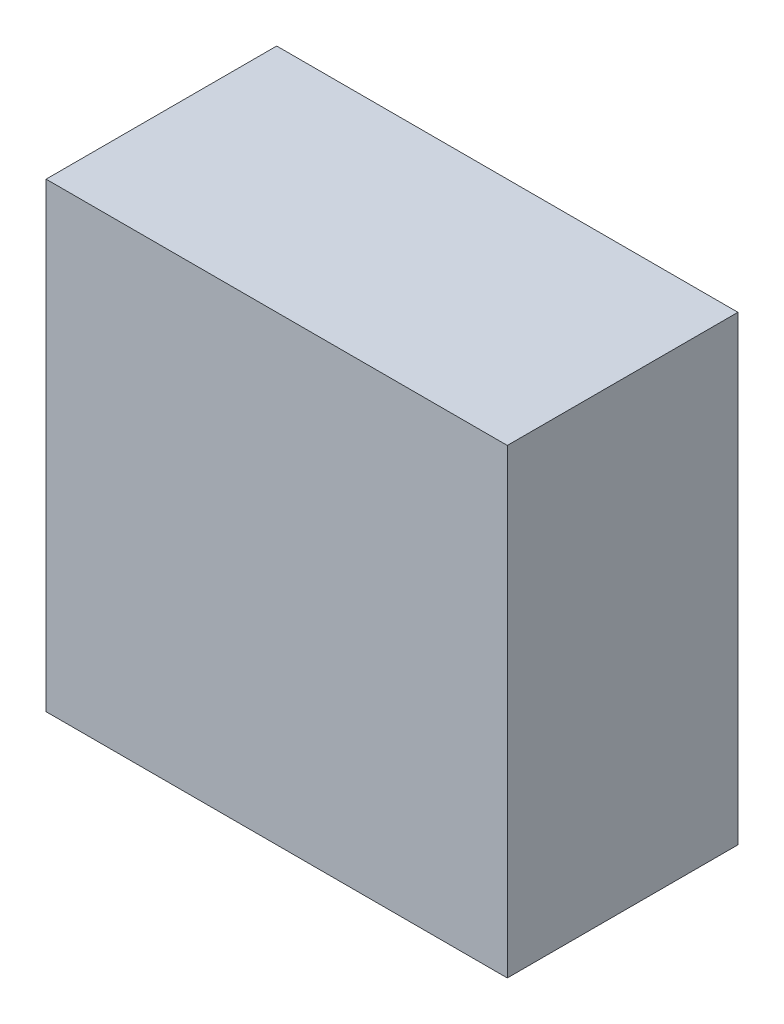
ISO-10303-21;
HEADER;
FILE_DESCRIPTION(('STEP AP214'),'2;1');
FILE_NAME('part.step','',(''),(''),'','','');
FILE_SCHEMA(('AUTOMOTIVE_DESIGN { 1 0 10303 214 1 1 1 1 }'));
ENDSEC;
DATA;
#1=APPLICATION_CONTEXT('core data for automotive mechanical design processes');
#2=APPLICATION_PROTOCOL_DEFINITION('international standard','automotive_design',2000,#1);
#3=PRODUCT_CONTEXT('',#1,'mechanical');
#4=PRODUCT('Part','Part','',(#3));
#5=PRODUCT_RELATED_PRODUCT_CATEGORY('part','',(#4));
#6=PRODUCT_DEFINITION_FORMATION('','',#4);
#7=PRODUCT_DEFINITION_CONTEXT('part definition',#1,'design');
#8=PRODUCT_DEFINITION('design','',#6,#7);
#9=PRODUCT_DEFINITION_SHAPE('','',#8);
#10=(LENGTH_UNIT() NAMED_UNIT(*) SI_UNIT(.MILLI.,.METRE.));
#11=(NAMED_UNIT(*) PLANE_ANGLE_UNIT() SI_UNIT($,.RADIAN.));
#12=(NAMED_UNIT(*) SI_UNIT($,.STERADIAN.) SOLID_ANGLE_UNIT());
#13=UNCERTAINTY_MEASURE_WITH_UNIT(LENGTH_MEASURE(1.E-05),#10,'distance_accuracy_value','');
#14=(GEOMETRIC_REPRESENTATION_CONTEXT(3) GLOBAL_UNCERTAINTY_ASSIGNED_CONTEXT((#13)) GLOBAL_UNIT_ASSIGNED_CONTEXT((#10,
#11,#12)) REPRESENTATION_CONTEXT('',''));
#15=CARTESIAN_POINT('',(0.,0.,0.));
#16=DIRECTION('',(0.,0.,1.));
#17=DIRECTION('',(1.,0.,0.));
#18=AXIS2_PLACEMENT_3D('',#15,#16,#17);
#19=CARTESIAN_POINT('',(0.,0.,2.75));
#20=DIRECTION('',(0.,0.,-1.));
#21=DIRECTION('',(-1.,0.,0.));
#22=AXIS2_PLACEMENT_3D('',#19,#20,#21);
#23=PLANE('',#22);
#24=DIRECTION('',(1.,0.,0.));
#25=VECTOR('',#24,1.);
#26=CARTESIAN_POINT('',(-97.9999999999999,165.941489418563,2.75));
#27=LINE('',#26,#25);
#28=CARTESIAN_POINT('',(-102.,165.941489418563,2.75));
#29=VERTEX_POINT('',#28);
#30=CARTESIAN_POINT('',(-97.9999999999999,165.941489418563,2.75));
#31=VERTEX_POINT('',#30);
#32=EDGE_CURVE('E80',#29,#31,#27,.T.);
#33=ORIENTED_EDGE('',*,*,#32,.T.);
#34=DIRECTION('',(0.,1.,0.));
#35=VECTOR('',#34,1.);
#36=CARTESIAN_POINT('',(-97.9999999999999,169.941489418563,2.75));
#37=LINE('',#36,#35);
#38=CARTESIAN_POINT('',(-97.9999999999999,169.941489418563,2.75));
#39=VERTEX_POINT('',#38);
#40=EDGE_CURVE('E55',#31,#39,#37,.T.);
#41=ORIENTED_EDGE('',*,*,#40,.T.);
#42=DIRECTION('',(1.,0.,0.));
#43=VECTOR('',#42,1.);
#44=CARTESIAN_POINT('',(-97.9999999999999,169.941489418563,2.75));
#45=LINE('',#44,#43);
#46=CARTESIAN_POINT('',(-102.,169.941489418563,2.75));
#47=VERTEX_POINT('',#46);
#48=EDGE_CURVE('E57',#39,#47,#45,.F.);
#49=ORIENTED_EDGE('',*,*,#48,.T.);
#50=DIRECTION('',(0.,1.,0.));
#51=VECTOR('',#50,1.);
#52=CARTESIAN_POINT('',(-102.,169.941489418563,2.75));
#53=LINE('',#52,#51);
#54=EDGE_CURVE('E20',#47,#29,#53,.F.);
#55=ORIENTED_EDGE('',*,*,#54,.T.);
#56=EDGE_LOOP('',(#33,#41,#49,#55));
#57=FACE_BOUND('',#56,.T.);
#58=ADVANCED_FACE('F17',(#57),#23,.F.);
#59=CARTESIAN_POINT('',(-102.,169.941489418563,2.75));
#60=DIRECTION('',(1.,0.,0.));
#61=DIRECTION('',(0.,0.,-1.));
#62=AXIS2_PLACEMENT_3D('',#59,#60,#61);
#63=PLANE('',#62);
#64=DIRECTION('',(0.,0.,1.));
#65=VECTOR('',#64,1.);
#66=CARTESIAN_POINT('',(-102.,165.941489418563,2.75));
#67=LINE('',#66,#65);
#68=CARTESIAN_POINT('',(-102.,165.941489418563,0.75));
#69=VERTEX_POINT('',#68);
#70=EDGE_CURVE('E68',#69,#29,#67,.T.);
#71=ORIENTED_EDGE('',*,*,#70,.T.);
#72=ORIENTED_EDGE('',*,*,#54,.F.);
#73=DIRECTION('',(0.,0.,-1.));
#74=VECTOR('',#73,1.);
#75=CARTESIAN_POINT('',(-102.,169.941489418563,2.75));
#76=LINE('',#75,#74);
#77=CARTESIAN_POINT('',(-102.,169.941489418563,0.75));
#78=VERTEX_POINT('',#77);
#79=EDGE_CURVE('E63',#47,#78,#76,.T.);
#80=ORIENTED_EDGE('',*,*,#79,.T.);
#81=DIRECTION('',(0.,1.,0.));
#82=VECTOR('',#81,1.);
#83=CARTESIAN_POINT('',(-102.,0.,0.75));
#84=LINE('',#83,#82);
#85=EDGE_CURVE('E83',#69,#78,#84,.T.);
#86=ORIENTED_EDGE('',*,*,#85,.F.);
#87=EDGE_LOOP('',(#71,#72,#80,#86));
#88=FACE_BOUND('',#87,.T.);
#89=ADVANCED_FACE('F65',(#88),#63,.F.);
#90=CARTESIAN_POINT('',(-97.9999999999999,169.941489418563,2.75));
#91=DIRECTION('',(0.,-1.,0.));
#92=DIRECTION('',(0.,0.,-1.));
#93=AXIS2_PLACEMENT_3D('',#90,#91,#92);
#94=PLANE('',#93);
#95=ORIENTED_EDGE('',*,*,#79,.F.);
#96=ORIENTED_EDGE('',*,*,#48,.F.);
#97=DIRECTION('',(0.,0.,1.));
#98=VECTOR('',#97,1.);
#99=CARTESIAN_POINT('',(-97.9999999999999,169.941489418563,2.75));
#100=LINE('',#99,#98);
#101=CARTESIAN_POINT('',(-97.9999999999999,169.941489418563,0.75));
#102=VERTEX_POINT('',#101);
#103=EDGE_CURVE('E75',#39,#102,#100,.F.);
#104=ORIENTED_EDGE('',*,*,#103,.T.);
#105=DIRECTION('',(-1.,0.,0.));
#106=VECTOR('',#105,1.);
#107=CARTESIAN_POINT('',(0.,169.941489418563,0.75));
#108=LINE('',#107,#106);
#109=EDGE_CURVE('E72',#78,#102,#108,.F.);
#110=ORIENTED_EDGE('',*,*,#109,.F.);
#111=EDGE_LOOP('',(#95,#96,#104,#110));
#112=FACE_BOUND('',#111,.T.);
#113=ADVANCED_FACE('F70',(#112),#94,.F.);
#114=CARTESIAN_POINT('',(-97.9999999999999,169.941489418563,2.75));
#115=DIRECTION('',(-1.,0.,0.));
#116=DIRECTION('',(0.,0.,1.));
#117=AXIS2_PLACEMENT_3D('',#114,#115,#116);
#118=PLANE('',#117);
#119=ORIENTED_EDGE('',*,*,#103,.F.);
#120=ORIENTED_EDGE('',*,*,#40,.F.);
#121=DIRECTION('',(0.,0.,1.));
#122=VECTOR('',#121,1.);
#123=CARTESIAN_POINT('',(-97.9999999999999,165.941489418563,2.75));
#124=LINE('',#123,#122);
#125=CARTESIAN_POINT('',(-97.9999999999999,165.941489418563,0.75));
#126=VERTEX_POINT('',#125);
#127=EDGE_CURVE('E35',#31,#126,#124,.F.);
#128=ORIENTED_EDGE('',*,*,#127,.T.);
#129=DIRECTION('',(0.,1.,0.));
#130=VECTOR('',#129,1.);
#131=CARTESIAN_POINT('',(-97.9999999999999,0.,0.75));
#132=LINE('',#131,#130);
#133=EDGE_CURVE('E26',#102,#126,#132,.F.);
#134=ORIENTED_EDGE('',*,*,#133,.F.);
#135=EDGE_LOOP('',(#119,#120,#128,#134));
#136=FACE_BOUND('',#135,.T.);
#137=ADVANCED_FACE('F89',(#136),#118,.F.);
#138=CARTESIAN_POINT('',(-97.9999999999999,165.941489418563,2.75));
#139=DIRECTION('',(0.,1.,0.));
#140=DIRECTION('',(0.,0.,1.));
#141=AXIS2_PLACEMENT_3D('',#138,#139,#140);
#142=PLANE('',#141);
#143=ORIENTED_EDGE('',*,*,#127,.F.);
#144=ORIENTED_EDGE('',*,*,#32,.F.);
#145=ORIENTED_EDGE('',*,*,#70,.F.);
#146=DIRECTION('',(-1.,0.,0.));
#147=VECTOR('',#146,1.);
#148=CARTESIAN_POINT('',(0.,165.941489418563,0.75));
#149=LINE('',#148,#147);
#150=EDGE_CURVE('E11',#126,#69,#149,.T.);
#151=ORIENTED_EDGE('',*,*,#150,.F.);
#152=EDGE_LOOP('',(#143,#144,#145,#151));
#153=FACE_BOUND('',#152,.T.);
#154=ADVANCED_FACE('F91',(#153),#142,.F.);
#155=CARTESIAN_POINT('',(0.,0.,0.75));
#156=DIRECTION('',(0.,0.,-1.));
#157=DIRECTION('',(-1.,0.,0.));
#158=AXIS2_PLACEMENT_3D('',#155,#156,#157);
#159=PLANE('',#158);
#160=ORIENTED_EDGE('',*,*,#133,.T.);
#161=ORIENTED_EDGE('',*,*,#150,.T.);
#162=ORIENTED_EDGE('',*,*,#85,.T.);
#163=ORIENTED_EDGE('',*,*,#109,.T.);
#164=EDGE_LOOP('',(#160,#161,#162,#163));
#165=FACE_BOUND('',#164,.T.);
#166=ADVANCED_FACE('F88',(#165),#159,.T.);
#167=CLOSED_SHELL('',(#58,#89,#113,#137,#154,#166));
#168=MANIFOLD_SOLID_BREP('B1',#167);
#169=ADVANCED_BREP_SHAPE_REPRESENTATION('',(#18,#168),#14);
#170=SHAPE_DEFINITION_REPRESENTATION(#9,#169);
ENDSEC;
END-ISO-10303-21;
